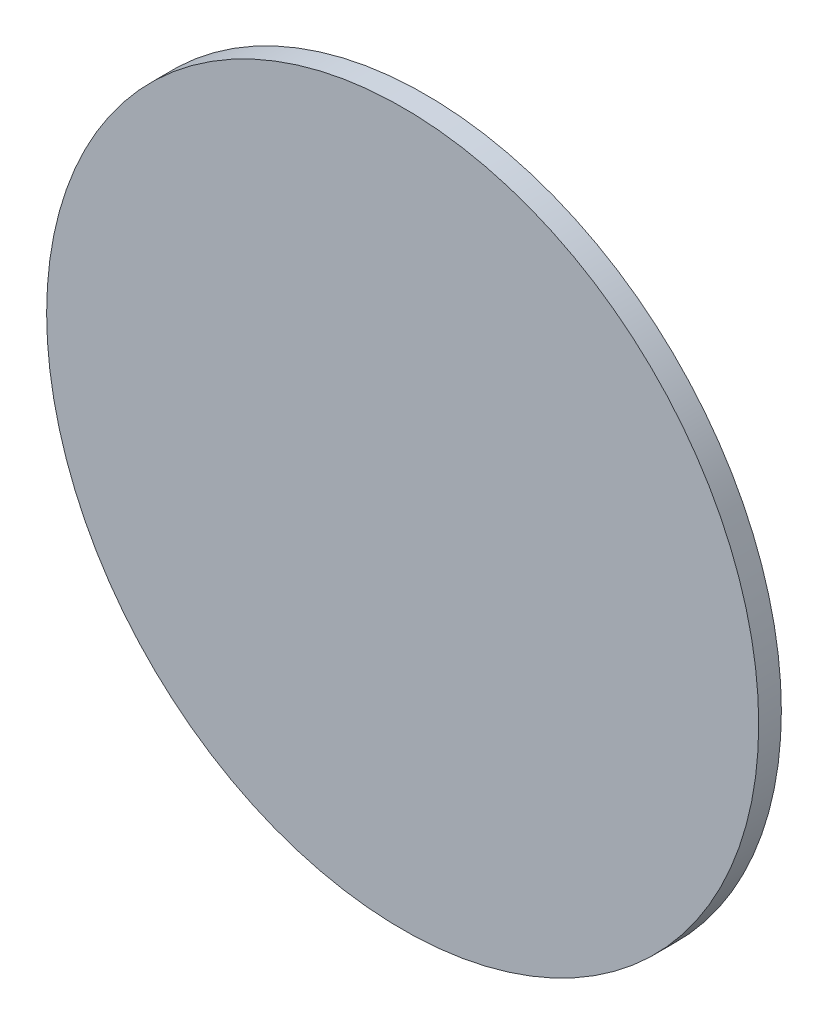
ISO-10303-21;
HEADER;
FILE_DESCRIPTION(('STEP AP214'),'2;1');
FILE_NAME('part.step','',(''),(''),'','','');
FILE_SCHEMA(('AUTOMOTIVE_DESIGN { 1 0 10303 214 1 1 1 1 }'));
ENDSEC;
DATA;
#1=APPLICATION_CONTEXT('core data for automotive mechanical design processes');
#2=APPLICATION_PROTOCOL_DEFINITION('international standard','automotive_design',2000,#1);
#3=PRODUCT_CONTEXT('',#1,'mechanical');
#4=PRODUCT('Part','Part','',(#3));
#5=PRODUCT_RELATED_PRODUCT_CATEGORY('part','',(#4));
#6=PRODUCT_DEFINITION_FORMATION('','',#4);
#7=PRODUCT_DEFINITION_CONTEXT('part definition',#1,'design');
#8=PRODUCT_DEFINITION('design','',#6,#7);
#9=PRODUCT_DEFINITION_SHAPE('','',#8);
#10=(LENGTH_UNIT() NAMED_UNIT(*) SI_UNIT(.MILLI.,.METRE.));
#11=(NAMED_UNIT(*) PLANE_ANGLE_UNIT() SI_UNIT($,.RADIAN.));
#12=(NAMED_UNIT(*) SI_UNIT($,.STERADIAN.) SOLID_ANGLE_UNIT());
#13=UNCERTAINTY_MEASURE_WITH_UNIT(LENGTH_MEASURE(1.E-05),#10,'distance_accuracy_value','');
#14=(GEOMETRIC_REPRESENTATION_CONTEXT(3) GLOBAL_UNCERTAINTY_ASSIGNED_CONTEXT((#13)) GLOBAL_UNIT_ASSIGNED_CONTEXT((#10,
#11,#12)) REPRESENTATION_CONTEXT('',''));
#15=CARTESIAN_POINT('',(0.,0.,0.));
#16=DIRECTION('',(0.,0.,1.));
#17=DIRECTION('',(1.,0.,0.));
#18=AXIS2_PLACEMENT_3D('',#15,#16,#17);
#19=CARTESIAN_POINT('',(0.,0.,1.5875));
#20=DIRECTION('',(0.,0.,-1.));
#21=DIRECTION('',(-1.,0.,0.));
#22=AXIS2_PLACEMENT_3D('',#19,#20,#21);
#23=CYLINDRICAL_SURFACE('',#22,24.9555);
#24=CARTESIAN_POINT('',(0.,0.,1.5875));
#25=DIRECTION('',(0.,0.,1.));
#26=DIRECTION('',(1.,0.,0.));
#27=AXIS2_PLACEMENT_3D('',#24,#25,#26);
#28=CIRCLE('',#27,24.9555);
#29=CARTESIAN_POINT('',(24.9555,0.,1.5875));
#30=VERTEX_POINT('',#29);
#31=EDGE_CURVE('E12',#30,#30,#28,.T.);
#32=ORIENTED_EDGE('',*,*,#31,.F.);
#33=EDGE_LOOP('',(#32));
#34=FACE_BOUND('',#33,.T.);
#35=CARTESIAN_POINT('',(0.,0.,0.));
#36=DIRECTION('',(0.,0.,1.));
#37=DIRECTION('',(1.,0.,0.));
#38=AXIS2_PLACEMENT_3D('',#35,#36,#37);
#39=CIRCLE('',#38,24.9555);
#40=CARTESIAN_POINT('',(24.9555,0.,0.));
#41=VERTEX_POINT('',#40);
#42=EDGE_CURVE('E51',#41,#41,#39,.T.);
#43=ORIENTED_EDGE('',*,*,#42,.T.);
#44=EDGE_LOOP('',(#43));
#45=FACE_BOUND('',#44,.T.);
#46=ADVANCED_FACE('F48',(#34,#45),#23,.T.);
#47=CARTESIAN_POINT('',(0.,0.,1.5875));
#48=DIRECTION('',(0.,0.,1.));
#49=DIRECTION('',(1.,0.,0.));
#50=AXIS2_PLACEMENT_3D('',#47,#48,#49);
#51=PLANE('',#50);
#52=ORIENTED_EDGE('',*,*,#31,.T.);
#53=EDGE_LOOP('',(#52));
#54=FACE_BOUND('',#53,.T.);
#55=ADVANCED_FACE('F65',(#54),#51,.T.);
#56=CARTESIAN_POINT('',(0.,0.,0.));
#57=DIRECTION('',(0.,0.,1.));
#58=DIRECTION('',(1.,0.,0.));
#59=AXIS2_PLACEMENT_3D('',#56,#57,#58);
#60=PLANE('',#59);
#61=ORIENTED_EDGE('',*,*,#42,.F.);
#62=EDGE_LOOP('',(#61));
#63=FACE_BOUND('',#62,.T.);
#64=ADVANCED_FACE('F63',(#63),#60,.F.);
#65=CLOSED_SHELL('',(#46,#55,#64));
#66=MANIFOLD_SOLID_BREP('B2',#65);
#67=ADVANCED_BREP_SHAPE_REPRESENTATION('',(#18,#66),#14);
#68=SHAPE_DEFINITION_REPRESENTATION(#9,#67);
ENDSEC;
END-ISO-10303-21;
